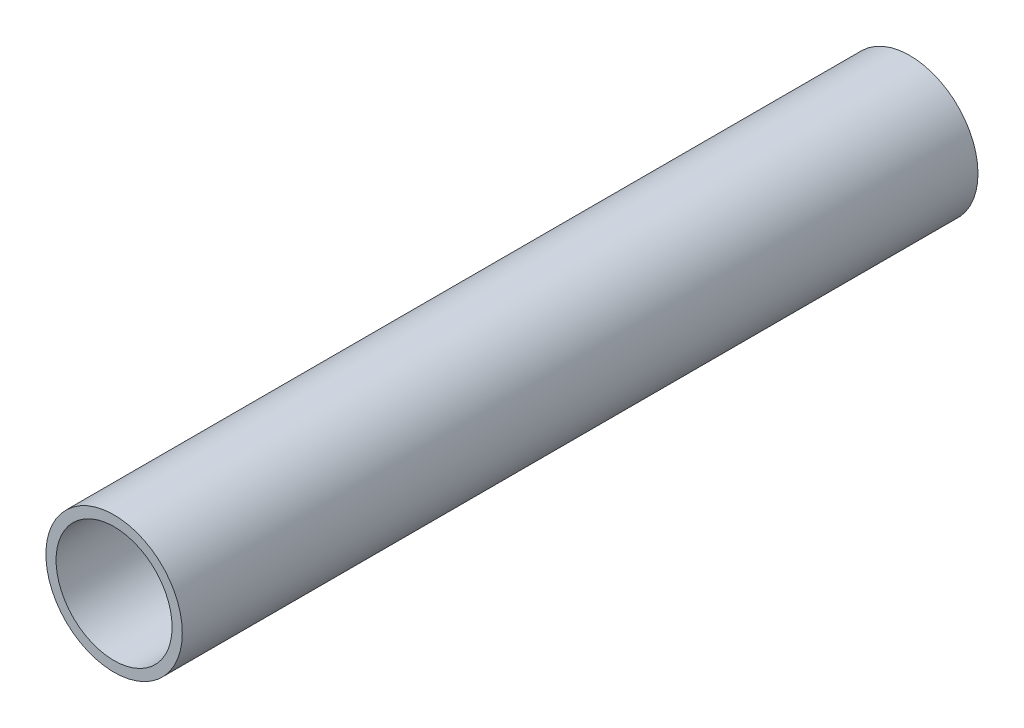
ISO-10303-21;
HEADER;
FILE_DESCRIPTION(('STEP AP214'),'2;1');
FILE_NAME('part.step','',(''),(''),'','','');
FILE_SCHEMA(('AUTOMOTIVE_DESIGN { 1 0 10303 214 1 1 1 1 }'));
ENDSEC;
DATA;
#1=APPLICATION_CONTEXT('core data for automotive mechanical design processes');
#2=APPLICATION_PROTOCOL_DEFINITION('international standard','automotive_design',2000,#1);
#3=PRODUCT_CONTEXT('',#1,'mechanical');
#4=PRODUCT('Part','Part','',(#3));
#5=PRODUCT_RELATED_PRODUCT_CATEGORY('part','',(#4));
#6=PRODUCT_DEFINITION_FORMATION('','',#4);
#7=PRODUCT_DEFINITION_CONTEXT('part definition',#1,'design');
#8=PRODUCT_DEFINITION('design','',#6,#7);
#9=PRODUCT_DEFINITION_SHAPE('','',#8);
#10=(LENGTH_UNIT() NAMED_UNIT(*) SI_UNIT(.MILLI.,.METRE.));
#11=(NAMED_UNIT(*) PLANE_ANGLE_UNIT() SI_UNIT($,.RADIAN.));
#12=(NAMED_UNIT(*) SI_UNIT($,.STERADIAN.) SOLID_ANGLE_UNIT());
#13=UNCERTAINTY_MEASURE_WITH_UNIT(LENGTH_MEASURE(1.E-05),#10,'distance_accuracy_value','');
#14=(GEOMETRIC_REPRESENTATION_CONTEXT(3) GLOBAL_UNCERTAINTY_ASSIGNED_CONTEXT((#13)) GLOBAL_UNIT_ASSIGNED_CONTEXT((#10,
#11,#12)) REPRESENTATION_CONTEXT('',''));
#15=CARTESIAN_POINT('',(0.,0.,0.));
#16=DIRECTION('',(0.,0.,1.));
#17=DIRECTION('',(1.,0.,0.));
#18=AXIS2_PLACEMENT_3D('',#15,#16,#17);
#19=CARTESIAN_POINT('',(0.,0.,27.78125));
#20=DIRECTION('',(0.,0.,1.));
#21=DIRECTION('',(1.,0.,0.));
#22=AXIS2_PLACEMENT_3D('',#19,#20,#21);
#23=PLANE('',#22);
#24=CARTESIAN_POINT('',(0.,0.,27.78125));
#25=DIRECTION('',(0.,0.,1.));
#26=DIRECTION('',(1.,0.,0.));
#27=AXIS2_PLACEMENT_3D('',#24,#25,#26);
#28=CIRCLE('',#27,4.7625);
#29=CARTESIAN_POINT('',(4.7625,0.,27.78125));
#30=VERTEX_POINT('',#29);
#31=EDGE_CURVE('E12',#30,#30,#28,.T.);
#32=ORIENTED_EDGE('',*,*,#31,.T.);
#33=EDGE_LOOP('',(#32));
#34=FACE_BOUND('',#33,.T.);
#35=CARTESIAN_POINT('',(0.,0.,27.78125));
#36=DIRECTION('',(0.,0.,1.));
#37=DIRECTION('',(1.,0.,0.));
#38=AXIS2_PLACEMENT_3D('',#35,#36,#37);
#39=CIRCLE('',#38,4.0513);
#40=CARTESIAN_POINT('',(4.0513,0.,27.78125));
#41=VERTEX_POINT('',#40);
#42=EDGE_CURVE('E51',#41,#41,#39,.T.);
#43=ORIENTED_EDGE('',*,*,#42,.F.);
#44=EDGE_LOOP('',(#43));
#45=FACE_BOUND('',#44,.T.);
#46=ADVANCED_FACE('F40',(#34,#45),#23,.T.);
#47=CARTESIAN_POINT('',(0.,0.,-27.78125));
#48=DIRECTION('',(0.,0.,1.));
#49=DIRECTION('',(1.,0.,0.));
#50=AXIS2_PLACEMENT_3D('',#47,#48,#49);
#51=PLANE('',#50);
#52=CARTESIAN_POINT('',(0.,0.,-27.78125));
#53=DIRECTION('',(0.,0.,1.));
#54=DIRECTION('',(1.,0.,0.));
#55=AXIS2_PLACEMENT_3D('',#52,#53,#54);
#56=CIRCLE('',#55,4.7625);
#57=CARTESIAN_POINT('',(4.7625,0.,-27.78125));
#58=VERTEX_POINT('',#57);
#59=EDGE_CURVE('E44',#58,#58,#56,.T.);
#60=ORIENTED_EDGE('',*,*,#59,.F.);
#61=EDGE_LOOP('',(#60));
#62=FACE_BOUND('',#61,.T.);
#63=CARTESIAN_POINT('',(0.,0.,-27.78125));
#64=DIRECTION('',(0.,0.,1.));
#65=DIRECTION('',(1.,0.,0.));
#66=AXIS2_PLACEMENT_3D('',#63,#64,#65);
#67=CIRCLE('',#66,4.0513);
#68=CARTESIAN_POINT('',(4.0513,0.,-27.78125));
#69=VERTEX_POINT('',#68);
#70=EDGE_CURVE('E53',#69,#69,#67,.T.);
#71=ORIENTED_EDGE('',*,*,#70,.T.);
#72=EDGE_LOOP('',(#71));
#73=FACE_BOUND('',#72,.T.);
#74=ADVANCED_FACE('F63',(#62,#73),#51,.F.);
#75=CARTESIAN_POINT('',(0.,0.,27.78125));
#76=DIRECTION('',(0.,0.,-1.));
#77=DIRECTION('',(-1.,0.,0.));
#78=AXIS2_PLACEMENT_3D('',#75,#76,#77);
#79=CYLINDRICAL_SURFACE('',#78,4.7625);
#80=ORIENTED_EDGE('',*,*,#31,.F.);
#81=EDGE_LOOP('',(#80));
#82=FACE_BOUND('',#81,.T.);
#83=ORIENTED_EDGE('',*,*,#59,.T.);
#84=EDGE_LOOP('',(#83));
#85=FACE_BOUND('',#84,.T.);
#86=ADVANCED_FACE('F42',(#82,#85),#79,.T.);
#87=CARTESIAN_POINT('',(0.,0.,27.78125));
#88=DIRECTION('',(0.,0.,-1.));
#89=DIRECTION('',(-1.,0.,0.));
#90=AXIS2_PLACEMENT_3D('',#87,#88,#89);
#91=CYLINDRICAL_SURFACE('',#90,4.0513);
#92=ORIENTED_EDGE('',*,*,#42,.T.);
#93=EDGE_LOOP('',(#92));
#94=FACE_BOUND('',#93,.T.);
#95=ORIENTED_EDGE('',*,*,#70,.F.);
#96=EDGE_LOOP('',(#95));
#97=FACE_BOUND('',#96,.T.);
#98=ADVANCED_FACE('F59',(#94,#97),#91,.F.);
#99=CLOSED_SHELL('',(#46,#74,#86,#98));
#100=MANIFOLD_SOLID_BREP('B2',#99);
#101=ADVANCED_BREP_SHAPE_REPRESENTATION('',(#18,#100),#14);
#102=SHAPE_DEFINITION_REPRESENTATION(#9,#101);
ENDSEC;
END-ISO-10303-21;
